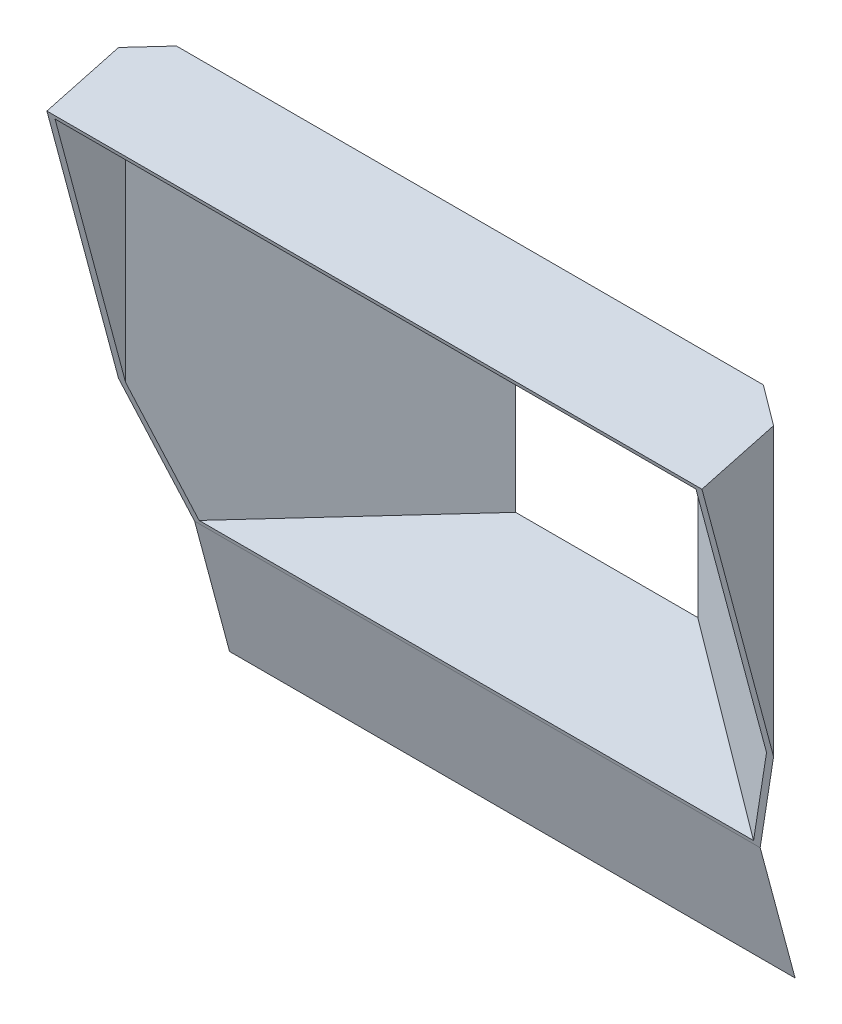
ISO-10303-21;
HEADER;
FILE_DESCRIPTION(('STEP AP214'),'2;1');
FILE_NAME('part.step','',(''),(''),'','','');
FILE_SCHEMA(('AUTOMOTIVE_DESIGN { 1 0 10303 214 1 1 1 1 }'));
ENDSEC;
DATA;
#1=APPLICATION_CONTEXT('core data for automotive mechanical design processes');
#2=APPLICATION_PROTOCOL_DEFINITION('international standard','automotive_design',2000,#1);
#3=PRODUCT_CONTEXT('',#1,'mechanical');
#4=PRODUCT('Part','Part','',(#3));
#5=PRODUCT_RELATED_PRODUCT_CATEGORY('part','',(#4));
#6=PRODUCT_DEFINITION_FORMATION('','',#4);
#7=PRODUCT_DEFINITION_CONTEXT('part definition',#1,'design');
#8=PRODUCT_DEFINITION('design','',#6,#7);
#9=PRODUCT_DEFINITION_SHAPE('','',#8);
#10=(LENGTH_UNIT() NAMED_UNIT(*) SI_UNIT(.MILLI.,.METRE.));
#11=(NAMED_UNIT(*) PLANE_ANGLE_UNIT() SI_UNIT($,.RADIAN.));
#12=(NAMED_UNIT(*) SI_UNIT($,.STERADIAN.) SOLID_ANGLE_UNIT());
#13=UNCERTAINTY_MEASURE_WITH_UNIT(LENGTH_MEASURE(1.E-05),#10,'distance_accuracy_value','');
#14=(GEOMETRIC_REPRESENTATION_CONTEXT(3) GLOBAL_UNCERTAINTY_ASSIGNED_CONTEXT((#13)) GLOBAL_UNIT_ASSIGNED_CONTEXT((#10,
#11,#12)) REPRESENTATION_CONTEXT('',''));
#15=CARTESIAN_POINT('',(0.,0.,0.));
#16=DIRECTION('',(0.,0.,1.));
#17=DIRECTION('',(1.,0.,0.));
#18=AXIS2_PLACEMENT_3D('',#15,#16,#17);
#19=CARTESIAN_POINT('',(209.569949024301,-91.2796819891189,95.8161254935994));
#20=DIRECTION('',(0.,-0.258819045102518,0.965925826289069));
#21=DIRECTION('',(0.,-0.965925826289069,-0.258819045102518));
#22=AXIS2_PLACEMENT_3D('',#19,#20,#21);
#23=PLANE('',#22);
#24=DIRECTION('',(0.,-0.965925826289069,-0.258819045102518));
#25=VECTOR('',#24,1.);
#26=CARTESIAN_POINT('',(-209.569949024304,-91.279681989119,95.8161254935994));
#27=LINE('',#26,#25);
#28=CARTESIAN_POINT('',(-209.569949024304,-91.279681989119,95.8161254935994));
#29=VERTEX_POINT('',#28);
#30=CARTESIAN_POINT('',(-209.569949024304,-187.872264618026,69.9342209833476));
#31=VERTEX_POINT('',#30);
#32=EDGE_CURVE('E13',#29,#31,#27,.T.);
#33=ORIENTED_EDGE('',*,*,#32,.T.);
#34=DIRECTION('',(-1.,0.,0.));
#35=VECTOR('',#34,1.);
#36=CARTESIAN_POINT('',(209.569949024301,-187.872264618026,69.9342209833477));
#37=LINE('',#36,#35);
#38=CARTESIAN_POINT('',(209.569949024301,-187.872264618026,69.9342209833477));
#39=VERTEX_POINT('',#38);
#40=EDGE_CURVE('E64',#39,#31,#37,.T.);
#41=ORIENTED_EDGE('',*,*,#40,.F.);
#42=DIRECTION('',(0.,-0.965925826289069,-0.258819045102518));
#43=VECTOR('',#42,1.);
#44=CARTESIAN_POINT('',(209.569949024301,-91.2796819891189,95.8161254935994));
#45=LINE('',#44,#43);
#46=CARTESIAN_POINT('',(209.569949024301,-91.2796819891189,95.8161254935994));
#47=VERTEX_POINT('',#46);
#48=EDGE_CURVE('E59',#47,#39,#45,.T.);
#49=ORIENTED_EDGE('',*,*,#48,.F.);
#50=DIRECTION('',(-1.,0.,0.));
#51=VECTOR('',#50,1.);
#52=CARTESIAN_POINT('',(209.569949024301,-91.2796819891189,95.8161254935994));
#53=LINE('',#52,#51);
#54=EDGE_CURVE('E77',#47,#29,#53,.T.);
#55=ORIENTED_EDGE('',*,*,#54,.T.);
#56=EDGE_LOOP('',(#33,#41,#49,#55));
#57=FACE_BOUND('',#56,.T.);
#58=ADVANCED_FACE('F58',(#57),#23,.T.);
#59=OPEN_SHELL('',(#58));
#60=SHELL_BASED_SURFACE_MODEL('B2',(#59));
#61=CARTESIAN_POINT('',(-22.2068201627576,0.,-31.714625951524));
#62=DIRECTION('',(0.573576436351033,0.,0.819152044289001));
#63=DIRECTION('',(0.819152044289001,0.,-0.573576436351033));
#64=AXIS2_PLACEMENT_3D('',#61,#62,#63);
#65=PLANE('',#64);
#66=DIRECTION('',(-0.633687274224652,0.633687274224638,0.44371260627965));
#67=VECTOR('',#66,1.);
#68=CARTESIAN_POINT('',(-67.5,62.5,0.));
#69=LINE('',#68,#67);
#70=CARTESIAN_POINT('',(-67.5,62.5,0.));
#71=VERTEX_POINT('',#70);
#72=CARTESIAN_POINT('',(-214.058541381897,209.058541381894,102.621395464621));
#73=VERTEX_POINT('',#72);
#74=EDGE_CURVE('E310',#71,#73,#69,.T.);
#75=ORIENTED_EDGE('',*,*,#74,.T.);
#76=DIRECTION('',(-0.80964576803791,-0.151905774945494,0.566920070059715));
#77=VECTOR('',#76,1.);
#78=CARTESIAN_POINT('',(-52.3459509247866,239.399064783086,-10.610979396864));
#79=LINE('',#78,#77);
#80=CARTESIAN_POINT('',(-237.500000000004,204.660453875223,119.035281495649));
#81=VERTEX_POINT('',#80);
#82=EDGE_CURVE('E119',#73,#81,#79,.T.);
#83=ORIENTED_EDGE('',*,*,#82,.T.);
#84=DIRECTION('',(0.,-1.,0.));
#85=VECTOR('',#84,1.);
#86=CARTESIAN_POINT('',(-237.500000000004,232.5,119.035281495649));
#87=LINE('',#86,#85);
#88=CARTESIAN_POINT('',(-237.500000000004,-4.62461208059924,119.035281495649));
#89=VERTEX_POINT('',#88);
#90=EDGE_CURVE('E105',#81,#89,#87,.T.);
#91=ORIENTED_EDGE('',*,*,#90,.T.);
#92=DIRECTION('',(0.346705173629565,-0.906013464377676,-0.242765576111719));
#93=VECTOR('',#92,1.);
#94=CARTESIAN_POINT('',(-200.385146462785,-101.613522517378,93.0471812693404));
#95=LINE('',#94,#93);
#96=CARTESIAN_POINT('',(-205.448504347551,-88.3819045102518,96.5925826289069));
#97=VERTEX_POINT('',#96);
#98=EDGE_CURVE('E213',#89,#97,#95,.T.);
#99=ORIENTED_EDGE('',*,*,#98,.T.);
#100=DIRECTION('',(-0.80964576803791,-0.151905774945495,0.566920070059715));
#101=VECTOR('',#100,1.);
#102=CARTESIAN_POINT('',(-67.5,-62.5,0.));
#103=LINE('',#102,#101);
#104=CARTESIAN_POINT('',(-67.5,-62.5,0.));
#105=VERTEX_POINT('',#104);
#106=EDGE_CURVE('E302',#105,#97,#103,.T.);
#107=ORIENTED_EDGE('',*,*,#106,.F.);
#108=DIRECTION('',(0.,-1.,0.));
#109=VECTOR('',#108,1.);
#110=CARTESIAN_POINT('',(-67.5,62.5,0.));
#111=LINE('',#110,#109);
#112=EDGE_CURVE('E335',#71,#105,#111,.T.);
#113=ORIENTED_EDGE('',*,*,#112,.F.);
#114=EDGE_LOOP('',(#75,#83,#91,#99,#107,#113));
#115=FACE_BOUND('',#114,.T.);
#116=ADVANCED_FACE('F101',(#115),#65,.T.);
#117=CARTESIAN_POINT('',(22.2068201627583,0.,-31.7146259515243));
#118=DIRECTION('',(-0.573576436351041,0.,0.819152044288995));
#119=DIRECTION('',(0.819152044288995,0.,0.573576436351041));
#120=AXIS2_PLACEMENT_3D('',#117,#118,#119);
#121=PLANE('',#120);
#122=DIRECTION('',(0.,1.,0.));
#123=VECTOR('',#122,1.);
#124=CARTESIAN_POINT('',(237.5,-94.3954075475701,119.035281495649));
#125=LINE('',#124,#123);
#126=CARTESIAN_POINT('',(237.5,-4.62461208059964,119.035281495649));
#127=VERTEX_POINT('',#126);
#128=CARTESIAN_POINT('',(237.5,204.660453875223,119.035281495649));
#129=VERTEX_POINT('',#128);
#130=EDGE_CURVE('E355',#127,#129,#125,.T.);
#131=ORIENTED_EDGE('',*,*,#130,.T.);
#132=DIRECTION('',(-0.809645768037904,0.151905774945496,-0.566920070059723));
#133=VECTOR('',#132,1.);
#134=CARTESIAN_POINT('',(52.3459509247875,239.399064783086,-10.6109793968636));
#135=LINE('',#134,#133);
#136=CARTESIAN_POINT('',(214.058541381894,209.058541381894,102.621395464621));
#137=VERTEX_POINT('',#136);
#138=EDGE_CURVE('E236',#129,#137,#135,.T.);
#139=ORIENTED_EDGE('',*,*,#138,.T.);
#140=DIRECTION('',(0.633687274224644,0.633687274224643,0.443712606279653));
#141=VECTOR('',#140,1.);
#142=CARTESIAN_POINT('',(67.5,62.5,0.));
#143=LINE('',#142,#141);
#144=CARTESIAN_POINT('',(67.5,62.5,0.));
#145=VERTEX_POINT('',#144);
#146=EDGE_CURVE('E317',#145,#137,#143,.T.);
#147=ORIENTED_EDGE('',*,*,#146,.F.);
#148=DIRECTION('',(0.,1.,0.));
#149=VECTOR('',#148,1.);
#150=CARTESIAN_POINT('',(67.5,62.5,0.));
#151=LINE('',#150,#149);
#152=CARTESIAN_POINT('',(67.5,-62.5,0.));
#153=VERTEX_POINT('',#152);
#154=EDGE_CURVE('E323',#153,#145,#151,.T.);
#155=ORIENTED_EDGE('',*,*,#154,.F.);
#156=DIRECTION('',(0.809645768037904,-0.151905774945496,0.566920070059723));
#157=VECTOR('',#156,1.);
#158=CARTESIAN_POINT('',(67.5,-62.5,0.));
#159=LINE('',#158,#157);
#160=CARTESIAN_POINT('',(205.448504347548,-88.3819045102517,96.592582628907));
#161=VERTEX_POINT('',#160);
#162=EDGE_CURVE('E314',#153,#161,#159,.T.);
#163=ORIENTED_EDGE('',*,*,#162,.T.);
#164=DIRECTION('',(0.346705173629558,0.906013464377678,0.24276557611172));
#165=VECTOR('',#164,1.);
#166=CARTESIAN_POINT('',(200.385146462783,-101.613522517376,93.047181269341));
#167=LINE('',#166,#165);
#168=EDGE_CURVE('E248',#161,#127,#167,.T.);
#169=ORIENTED_EDGE('',*,*,#168,.T.);
#170=EDGE_LOOP('',(#131,#139,#147,#155,#163,#169));
#171=FACE_BOUND('',#170,.T.);
#172=ADVANCED_FACE('F289',(#171),#121,.T.);
#173=CARTESIAN_POINT('',(-237.500000000004,-94.3954075475703,119.035281495649));
#174=DIRECTION('',(1.,0.,0.));
#175=DIRECTION('',(0.,1.,0.));
#176=AXIS2_PLACEMENT_3D('',#173,#174,#175);
#177=PLANE('',#176);
#178=ORIENTED_EDGE('',*,*,#90,.F.);
#179=DIRECTION('',(0.,0.258819045102518,-0.965925826289069));
#180=VECTOR('',#179,1.);
#181=CARTESIAN_POINT('',(-237.500000000004,220.709623414522,59.1389653556977));
#182=LINE('',#181,#180);
#183=CARTESIAN_POINT('',(-237.500000000004,190.641012772534,171.356547984604));
#184=VERTEX_POINT('',#183);
#185=EDGE_CURVE('E219',#184,#81,#182,.T.);
#186=ORIENTED_EDGE('',*,*,#185,.F.);
#187=DIRECTION('',(0.,-0.965925826289069,-0.258819045102518));
#188=VECTOR('',#187,1.);
#189=CARTESIAN_POINT('',(-237.500000000004,-88.3819045102518,96.5925826289069));
#190=LINE('',#189,#188);
#191=EDGE_CURVE('E207',#184,#89,#190,.T.);
#192=ORIENTED_EDGE('',*,*,#191,.T.);
#193=EDGE_LOOP('',(#178,#186,#192));
#194=FACE_BOUND('',#193,.T.);
#195=ADVANCED_FACE('F220',(#194),#177,.T.);
#196=CARTESIAN_POINT('',(237.5,207.766282416453,119.035281495649));
#197=DIRECTION('',(-1.,0.,0.));
#198=DIRECTION('',(0.,-1.,0.));
#199=AXIS2_PLACEMENT_3D('',#196,#197,#198);
#200=PLANE('',#199);
#201=DIRECTION('',(0.,0.965925826289069,0.258819045102518));
#202=VECTOR('',#201,1.);
#203=CARTESIAN_POINT('',(237.5,193.538790251401,172.133005119912));
#204=LINE('',#203,#202);
#205=CARTESIAN_POINT('',(237.5,190.641012772534,171.356547984604));
#206=VERTEX_POINT('',#205);
#207=EDGE_CURVE('E56',#127,#206,#204,.T.);
#208=ORIENTED_EDGE('',*,*,#207,.T.);
#209=DIRECTION('',(0.,-0.258819045102518,0.965925826289069));
#210=VECTOR('',#209,1.);
#211=CARTESIAN_POINT('',(237.5,220.709623414522,59.1389653556977));
#212=LINE('',#211,#210);
#213=EDGE_CURVE('E126',#129,#206,#212,.T.);
#214=ORIENTED_EDGE('',*,*,#213,.F.);
#215=ORIENTED_EDGE('',*,*,#130,.F.);
#216=EDGE_LOOP('',(#208,#214,#215));
#217=FACE_BOUND('',#216,.T.);
#218=ADVANCED_FACE('F371',(#217),#200,.T.);
#219=CARTESIAN_POINT('',(0.,20.5618705210725,-29.3653943995595));
#220=DIRECTION('',(0.,0.573576436351042,-0.819152044288995));
#221=DIRECTION('',(0.,0.819152044288995,0.573576436351042));
#222=AXIS2_PLACEMENT_3D('',#219,#220,#221);
#223=PLANE('',#222);
#224=DIRECTION('',(1.,0.,0.));
#225=VECTOR('',#224,1.);
#226=CARTESIAN_POINT('',(0.,209.058541381894,102.621395464621));
#227=LINE('',#226,#225);
#228=EDGE_CURVE('E227',#73,#137,#227,.T.);
#229=ORIENTED_EDGE('',*,*,#228,.F.);
#230=ORIENTED_EDGE('',*,*,#74,.F.);
#231=DIRECTION('',(-1.,0.,0.));
#232=VECTOR('',#231,1.);
#233=CARTESIAN_POINT('',(-67.5,62.5,0.));
#234=LINE('',#233,#232);
#235=EDGE_CURVE('E311',#145,#71,#234,.T.);
#236=ORIENTED_EDGE('',*,*,#235,.F.);
#237=ORIENTED_EDGE('',*,*,#146,.T.);
#238=EDGE_LOOP('',(#229,#230,#236,#237));
#239=FACE_BOUND('',#238,.T.);
#240=ADVANCED_FACE('F292',(#239),#223,.F.);
#241=CARTESIAN_POINT('',(-23.9275494718107,0.,-34.172082084391));
#242=DIRECTION('',(0.573576436351033,0.,0.819152044289001));
#243=DIRECTION('',(0.819152044289001,0.,-0.573576436351033));
#244=AXIS2_PLACEMENT_3D('',#241,#242,#243);
#245=PLANE('',#244);
#246=DIRECTION('',(0.346705173629565,-0.906013464377676,-0.242765576111719));
#247=VECTOR('',#246,1.);
#248=CARTESIAN_POINT('',(-204.986776516709,-103.256474714697,92.6069535548658));
#249=LINE('',#248,#247);
#250=CARTESIAN_POINT('',(-242.730340386867,-4.62461208059975,119.035281495649));
#251=VERTEX_POINT('',#250);
#252=CARTESIAN_POINT('',(-209.569949024304,-91.279681989119,95.8161254935994));
#253=VERTEX_POINT('',#252);
#254=EDGE_CURVE('E465',#251,#253,#249,.T.);
#255=ORIENTED_EDGE('',*,*,#254,.F.);
#256=DIRECTION('',(0.,-1.,0.));
#257=VECTOR('',#256,1.);
#258=CARTESIAN_POINT('',(-242.730340386867,-1.2365643862711E-13,119.035281495649));
#259=LINE('',#258,#257);
#260=CARTESIAN_POINT('',(-242.730340386867,207.766282416453,119.035281495649));
#261=VERTEX_POINT('',#260);
#262=EDGE_CURVE('E111',#261,#251,#259,.T.);
#263=ORIENTED_EDGE('',*,*,#262,.F.);
#264=DIRECTION('',(0.80964576803791,0.151905774945494,-0.566920070059715));
#265=VECTOR('',#264,1.);
#266=CARTESIAN_POINT('',(-54.5296512303528,243.076504071633,-12.7442597480001));
#267=LINE('',#266,#265);
#268=CARTESIAN_POINT('',(-217.500000000004,212.5,101.368806965171));
#269=VERTEX_POINT('',#268);
#270=EDGE_CURVE('E476',#261,#269,#267,.T.);
#271=ORIENTED_EDGE('',*,*,#270,.T.);
#272=DIRECTION('',(-0.633687274224652,0.633687274224638,0.44371260627965));
#273=VECTOR('',#272,1.);
#274=CARTESIAN_POINT('',(-16.3270110053705,11.3270110053717,-39.4940364130451));
#275=LINE('',#274,#273);
#276=CARTESIAN_POINT('',(-72.7303403868634,67.7303403868633,0.));
#277=VERTEX_POINT('',#276);
#278=EDGE_CURVE('E456',#277,#269,#275,.T.);
#279=ORIENTED_EDGE('',*,*,#278,.F.);
#280=DIRECTION('',(0.,-1.,0.));
#281=VECTOR('',#280,1.);
#282=CARTESIAN_POINT('',(-72.7303403868634,0.,0.));
#283=LINE('',#282,#281);
#284=CARTESIAN_POINT('',(-72.7303403868633,-65.6058285412302,0.));
#285=VERTEX_POINT('',#284);
#286=EDGE_CURVE('E441',#277,#285,#283,.T.);
#287=ORIENTED_EDGE('',*,*,#286,.T.);
#288=DIRECTION('',(-0.80964576803791,-0.151905774945495,0.566920070059715));
#289=VECTOR('',#288,1.);
#290=CARTESIAN_POINT('',(-16.9848394780835,-55.1468551857659,-39.0334199576025));
#291=LINE('',#290,#289);
#292=EDGE_CURVE('E353',#285,#253,#291,.T.);
#293=ORIENTED_EDGE('',*,*,#292,.T.);
#294=EDGE_LOOP('',(#255,#263,#271,#279,#287,#293));
#295=FACE_BOUND('',#294,.T.);
#296=ADVANCED_FACE('F370',(#295),#245,.F.);
#297=CARTESIAN_POINT('',(0.,-61.211071347131,-16.4014571353074));
#298=DIRECTION('',(0.,-0.965925826289069,-0.258819045102518));
#299=DIRECTION('',(0.,0.258819045102518,-0.965925826289069));
#300=AXIS2_PLACEMENT_3D('',#297,#298,#299);
#301=PLANE('',#300);
#302=DIRECTION('',(0.809645768037904,-0.151905774945496,0.566920070059723));
#303=VECTOR('',#302,1.);
#304=CARTESIAN_POINT('',(16.9848394780842,-55.1468551857658,-39.0334199576029));
#305=LINE('',#304,#303);
#306=CARTESIAN_POINT('',(72.7303403868633,-65.6058285412302,0.));
#307=VERTEX_POINT('',#306);
#308=CARTESIAN_POINT('',(209.569949024301,-91.2796819891188,95.8161254935994));
#309=VERTEX_POINT('',#308);
#310=EDGE_CURVE('E453',#307,#309,#305,.T.);
#311=ORIENTED_EDGE('',*,*,#310,.T.);
#312=DIRECTION('',(-1.,0.,0.));
#313=VECTOR('',#312,1.);
#314=CARTESIAN_POINT('',(246.813932689732,-91.2796819891188,95.8161254935994));
#315=LINE('',#314,#313);
#316=EDGE_CURVE('E241',#309,#253,#315,.T.);
#317=ORIENTED_EDGE('',*,*,#316,.T.);
#318=ORIENTED_EDGE('',*,*,#292,.F.);
#319=DIRECTION('',(1.,0.,0.));
#320=VECTOR('',#319,1.);
#321=CARTESIAN_POINT('',(0.,-65.6058285412302,0.));
#322=LINE('',#321,#320);
#323=EDGE_CURVE('E439',#285,#307,#322,.T.);
#324=ORIENTED_EDGE('',*,*,#323,.T.);
#325=EDGE_LOOP('',(#311,#317,#318,#324));
#326=FACE_BOUND('',#325,.T.);
#327=ADVANCED_FACE('F376',(#326),#301,.T.);
#328=CARTESIAN_POINT('',(23.9275494718114,0.,-34.1720820843913));
#329=DIRECTION('',(-0.573576436351041,0.,0.819152044288995));
#330=DIRECTION('',(0.819152044288995,0.,0.573576436351041));
#331=AXIS2_PLACEMENT_3D('',#328,#329,#330);
#332=PLANE('',#331);
#333=DIRECTION('',(0.346705173629558,0.906013464377678,0.24276557611172));
#334=VECTOR('',#333,1.);
#335=CARTESIAN_POINT('',(204.986776516707,-103.256474714695,92.6069535548664));
#336=LINE('',#335,#334);
#337=CARTESIAN_POINT('',(242.730340386864,-4.62461208059964,119.035281495649));
#338=VERTEX_POINT('',#337);
#339=EDGE_CURVE('E215',#309,#338,#336,.T.);
#340=ORIENTED_EDGE('',*,*,#339,.F.);
#341=ORIENTED_EDGE('',*,*,#310,.F.);
#342=DIRECTION('',(0.,1.,0.));
#343=VECTOR('',#342,1.);
#344=CARTESIAN_POINT('',(72.7303403868633,0.,0.));
#345=LINE('',#344,#343);
#346=CARTESIAN_POINT('',(72.7303403868633,67.7303403868633,0.));
#347=VERTEX_POINT('',#346);
#348=EDGE_CURVE('E357',#307,#347,#345,.T.);
#349=ORIENTED_EDGE('',*,*,#348,.T.);
#350=DIRECTION('',(0.633687274224644,0.633687274224643,0.443712606279653));
#351=VECTOR('',#350,1.);
#352=CARTESIAN_POINT('',(16.3270110053714,11.3270110053714,-39.4940364130454));
#353=LINE('',#352,#351);
#354=CARTESIAN_POINT('',(217.5,212.5,101.368806965171));
#355=VERTEX_POINT('',#354);
#356=EDGE_CURVE('E450',#347,#355,#353,.T.);
#357=ORIENTED_EDGE('',*,*,#356,.T.);
#358=DIRECTION('',(0.809645768037904,-0.151905774945496,0.566920070059723));
#359=VECTOR('',#358,1.);
#360=CARTESIAN_POINT('',(54.5296512303537,243.076504071632,-12.7442597479996));
#361=LINE('',#360,#359);
#362=CARTESIAN_POINT('',(242.730340386864,207.766282416453,119.035281495649));
#363=VERTEX_POINT('',#362);
#364=EDGE_CURVE('E478',#355,#363,#361,.T.);
#365=ORIENTED_EDGE('',*,*,#364,.T.);
#366=DIRECTION('',(0.,1.,0.));
#367=VECTOR('',#366,1.);
#368=CARTESIAN_POINT('',(242.730340386864,0.,119.035281495649));
#369=LINE('',#368,#367);
#370=EDGE_CURVE('E448',#338,#363,#369,.T.);
#371=ORIENTED_EDGE('',*,*,#370,.F.);
#372=EDGE_LOOP('',(#340,#341,#349,#357,#365,#371));
#373=FACE_BOUND('',#372,.T.);
#374=ADVANCED_FACE('F103',(#373),#332,.F.);
#375=CARTESIAN_POINT('',(0.,-58.3132938682638,-15.6249999999998));
#376=DIRECTION('',(0.,-0.965925826289069,-0.258819045102518));
#377=DIRECTION('',(0.,0.258819045102518,-0.965925826289069));
#378=AXIS2_PLACEMENT_3D('',#375,#376,#377);
#379=PLANE('',#378);
#380=DIRECTION('',(-1.,0.,0.));
#381=VECTOR('',#380,1.);
#382=CARTESIAN_POINT('',(0.,-88.3819045102517,96.5925826289069));
#383=LINE('',#382,#381);
#384=EDGE_CURVE('E251',#161,#97,#383,.T.);
#385=ORIENTED_EDGE('',*,*,#384,.F.);
#386=ORIENTED_EDGE('',*,*,#162,.F.);
#387=DIRECTION('',(1.,0.,0.));
#388=VECTOR('',#387,1.);
#389=CARTESIAN_POINT('',(-67.5,-62.5,0.));
#390=LINE('',#389,#388);
#391=EDGE_CURVE('E329',#105,#153,#390,.T.);
#392=ORIENTED_EDGE('',*,*,#391,.F.);
#393=ORIENTED_EDGE('',*,*,#106,.T.);
#394=EDGE_LOOP('',(#385,#386,#392,#393));
#395=FACE_BOUND('',#394,.T.);
#396=ADVANCED_FACE('F399',(#395),#379,.F.);
#397=CARTESIAN_POINT('',(300.279163492915,196.194400158541,162.222134021382));
#398=DIRECTION('',(0.,-0.965925826289069,-0.258819045102518));
#399=DIRECTION('',(0.,0.258819045102518,-0.965925826289069));
#400=AXIS2_PLACEMENT_3D('',#397,#398,#399);
#401=PLANE('',#400);
#402=DIRECTION('',(-1.,0.,0.));
#403=VECTOR('',#402,1.);
#404=CARTESIAN_POINT('',(0.,212.5,101.368806965171));
#405=LINE('',#404,#403);
#406=EDGE_CURVE('E330',#355,#269,#405,.T.);
#407=ORIENTED_EDGE('',*,*,#406,.T.);
#408=ORIENTED_EDGE('',*,*,#270,.F.);
#409=DIRECTION('',(0.,-0.258819045102518,0.965925826289069));
#410=VECTOR('',#409,1.);
#411=CARTESIAN_POINT('',(-242.730340386867,207.766282416453,119.035281495649));
#412=LINE('',#411,#410);
#413=CARTESIAN_POINT('',(-242.730340386867,193.538790251402,172.133005119912));
#414=VERTEX_POINT('',#413);
#415=EDGE_CURVE('E485',#261,#414,#412,.T.);
#416=ORIENTED_EDGE('',*,*,#415,.T.);
#417=DIRECTION('',(-1.,0.,0.));
#418=VECTOR('',#417,1.);
#419=CARTESIAN_POINT('',(300.279163492915,193.538790251401,172.133005119912));
#420=LINE('',#419,#418);
#421=CARTESIAN_POINT('',(242.730340386864,193.538790251401,172.133005119912));
#422=VERTEX_POINT('',#421);
#423=EDGE_CURVE('E246',#422,#414,#420,.T.);
#424=ORIENTED_EDGE('',*,*,#423,.F.);
#425=DIRECTION('',(0.,-0.258819045102518,0.965925826289069));
#426=VECTOR('',#425,1.);
#427=CARTESIAN_POINT('',(242.730340386864,207.766282416453,119.035281495649));
#428=LINE('',#427,#426);
#429=EDGE_CURVE('E482',#363,#422,#428,.T.);
#430=ORIENTED_EDGE('',*,*,#429,.F.);
#431=ORIENTED_EDGE('',*,*,#364,.F.);
#432=EDGE_LOOP('',(#407,#408,#416,#424,#430,#431));
#433=FACE_BOUND('',#432,.T.);
#434=ADVANCED_FACE('F290',(#433),#401,.F.);
#435=CARTESIAN_POINT('',(-242.730340386867,207.766282416453,119.035281495649));
#436=DIRECTION('',(-1.,0.,0.));
#437=DIRECTION('',(0.,-1.,0.));
#438=AXIS2_PLACEMENT_3D('',#435,#436,#437);
#439=PLANE('',#438);
#440=ORIENTED_EDGE('',*,*,#262,.T.);
#441=DIRECTION('',(0.,0.965925826289069,0.258819045102518));
#442=VECTOR('',#441,1.);
#443=CARTESIAN_POINT('',(-242.730340386867,193.538790251401,172.133005119912));
#444=LINE('',#443,#442);
#445=EDGE_CURVE('E488',#251,#414,#444,.T.);
#446=ORIENTED_EDGE('',*,*,#445,.T.);
#447=ORIENTED_EDGE('',*,*,#415,.F.);
#448=EDGE_LOOP('',(#440,#446,#447));
#449=FACE_BOUND('',#448,.T.);
#450=ADVANCED_FACE('F405',(#449),#439,.T.);
#451=CARTESIAN_POINT('',(242.730340386864,-97.5012360888003,119.035281495649));
#452=DIRECTION('',(1.,0.,0.));
#453=DIRECTION('',(0.,0.,-1.));
#454=AXIS2_PLACEMENT_3D('',#451,#452,#453);
#455=PLANE('',#454);
#456=ORIENTED_EDGE('',*,*,#429,.T.);
#457=DIRECTION('',(0.,-0.965925826289069,-0.258819045102518));
#458=VECTOR('',#457,1.);
#459=CARTESIAN_POINT('',(242.730340386864,-91.2796819891189,95.8161254935994));
#460=LINE('',#459,#458);
#461=EDGE_CURVE('E216',#422,#338,#460,.T.);
#462=ORIENTED_EDGE('',*,*,#461,.T.);
#463=ORIENTED_EDGE('',*,*,#370,.T.);
#464=EDGE_LOOP('',(#456,#462,#463));
#465=FACE_BOUND('',#464,.T.);
#466=ADVANCED_FACE('F385',(#465),#455,.T.);
#467=CARTESIAN_POINT('',(0.,0.,0.));
#468=DIRECTION('',(0.,0.,1.));
#469=DIRECTION('',(1.,0.,0.));
#470=AXIS2_PLACEMENT_3D('',#467,#468,#469);
#471=PLANE('',#470);
#472=ORIENTED_EDGE('',*,*,#348,.F.);
#473=ORIENTED_EDGE('',*,*,#323,.F.);
#474=ORIENTED_EDGE('',*,*,#286,.F.);
#475=DIRECTION('',(-1.,0.,0.));
#476=VECTOR('',#475,1.);
#477=CARTESIAN_POINT('',(0.,67.7303403868633,0.));
#478=LINE('',#477,#476);
#479=EDGE_CURVE('E444',#347,#277,#478,.T.);
#480=ORIENTED_EDGE('',*,*,#479,.F.);
#481=EDGE_LOOP('',(#472,#473,#474,#480));
#482=FACE_BOUND('',#481,.T.);
#483=ORIENTED_EDGE('',*,*,#154,.T.);
#484=ORIENTED_EDGE('',*,*,#235,.T.);
#485=ORIENTED_EDGE('',*,*,#112,.T.);
#486=ORIENTED_EDGE('',*,*,#391,.T.);
#487=EDGE_LOOP('',(#483,#484,#485,#486));
#488=FACE_BOUND('',#487,.T.);
#489=ADVANCED_FACE('F334',(#482,#488),#471,.F.);
#490=CARTESIAN_POINT('',(0.,22.2825998301256,-31.8228505324265));
#491=DIRECTION('',(0.,0.573576436351042,-0.819152044288995));
#492=DIRECTION('',(0.,0.819152044288995,0.573576436351042));
#493=AXIS2_PLACEMENT_3D('',#490,#491,#492);
#494=PLANE('',#493);
#495=ORIENTED_EDGE('',*,*,#406,.F.);
#496=ORIENTED_EDGE('',*,*,#356,.F.);
#497=ORIENTED_EDGE('',*,*,#479,.T.);
#498=ORIENTED_EDGE('',*,*,#278,.T.);
#499=EDGE_LOOP('',(#495,#496,#497,#498));
#500=FACE_BOUND('',#499,.T.);
#501=ADVANCED_FACE('F414',(#500),#494,.T.);
#502=CARTESIAN_POINT('',(246.813932689732,212.444302528357,177.198721867019));
#503=DIRECTION('',(0.,-0.258819045102518,0.965925826289069));
#504=DIRECTION('',(0.,-0.965925826289069,-0.258819045102518));
#505=AXIS2_PLACEMENT_3D('',#502,#503,#504);
#506=PLANE('',#505);
#507=ORIENTED_EDGE('',*,*,#423,.T.);
#508=ORIENTED_EDGE('',*,*,#445,.F.);
#509=ORIENTED_EDGE('',*,*,#254,.T.);
#510=ORIENTED_EDGE('',*,*,#316,.F.);
#511=ORIENTED_EDGE('',*,*,#339,.T.);
#512=ORIENTED_EDGE('',*,*,#461,.F.);
#513=EDGE_LOOP('',(#507,#508,#509,#510,#511,#512));
#514=FACE_BOUND('',#513,.T.);
#515=DIRECTION('',(1.,0.,0.));
#516=VECTOR('',#515,1.);
#517=CARTESIAN_POINT('',(0.,190.641012772534,171.356547984604));
#518=LINE('',#517,#516);
#519=EDGE_CURVE('E211',#184,#206,#518,.T.);
#520=ORIENTED_EDGE('',*,*,#519,.T.);
#521=ORIENTED_EDGE('',*,*,#207,.F.);
#522=ORIENTED_EDGE('',*,*,#168,.F.);
#523=ORIENTED_EDGE('',*,*,#384,.T.);
#524=ORIENTED_EDGE('',*,*,#98,.F.);
#525=ORIENTED_EDGE('',*,*,#191,.F.);
#526=EDGE_LOOP('',(#520,#521,#522,#523,#524,#525));
#527=FACE_BOUND('',#526,.T.);
#528=ADVANCED_FACE('F209',(#514,#527),#506,.T.);
#529=CARTESIAN_POINT('',(0.,220.709623414522,59.1389653556977));
#530=DIRECTION('',(0.,0.965925826289069,0.258819045102518));
#531=DIRECTION('',(0.,-0.258819045102518,0.965925826289069));
#532=AXIS2_PLACEMENT_3D('',#529,#530,#531);
#533=PLANE('',#532);
#534=ORIENTED_EDGE('',*,*,#82,.F.);
#535=ORIENTED_EDGE('',*,*,#228,.T.);
#536=ORIENTED_EDGE('',*,*,#138,.F.);
#537=ORIENTED_EDGE('',*,*,#213,.T.);
#538=ORIENTED_EDGE('',*,*,#519,.F.);
#539=ORIENTED_EDGE('',*,*,#185,.T.);
#540=EDGE_LOOP('',(#534,#535,#536,#537,#538,#539));
#541=FACE_BOUND('',#540,.T.);
#542=ADVANCED_FACE('F224',(#541),#533,.F.);
#543=CLOSED_SHELL('',(#116,#172,#195,#218,#240,#296,#327,#374,#396,#434,#450,#466,#489,#501,
#528,#542));
#544=MANIFOLD_SOLID_BREP('B7',#543);
#545=ADVANCED_BREP_SHAPE_REPRESENTATION('',(#18,#544),#14);
#546=MANIFOLD_SURFACE_SHAPE_REPRESENTATION('',(#18,#60),#14);
#547=SHAPE_REPRESENTATION('',(#18),#14);
#548=SHAPE_DEFINITION_REPRESENTATION(#9,#547);
#549=SHAPE_REPRESENTATION_RELATIONSHIP('','',#547,#545);
#550=SHAPE_REPRESENTATION_RELATIONSHIP('','',#547,#546);
ENDSEC;
END-ISO-10303-21;
